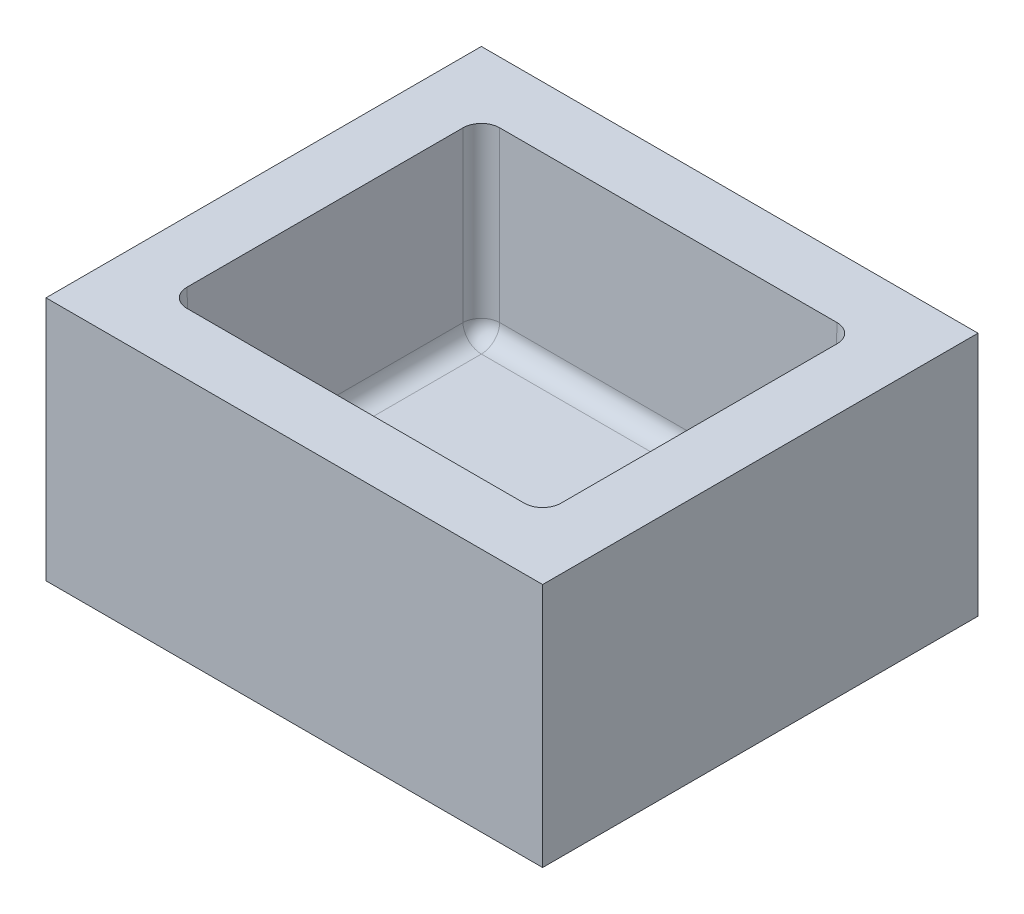
ISO-10303-21;
HEADER;
FILE_DESCRIPTION(('STEP AP214'),'2;1');
FILE_NAME('part.step','',(''),(''),'','','');
FILE_SCHEMA(('AUTOMOTIVE_DESIGN { 1 0 10303 214 1 1 1 1 }'));
ENDSEC;
DATA;
#1=APPLICATION_CONTEXT('core data for automotive mechanical design processes');
#2=APPLICATION_PROTOCOL_DEFINITION('international standard','automotive_design',2000,#1);
#3=PRODUCT_CONTEXT('',#1,'mechanical');
#4=PRODUCT('Part','Part','',(#3));
#5=PRODUCT_RELATED_PRODUCT_CATEGORY('part','',(#4));
#6=PRODUCT_DEFINITION_FORMATION('','',#4);
#7=PRODUCT_DEFINITION_CONTEXT('part definition',#1,'design');
#8=PRODUCT_DEFINITION('design','',#6,#7);
#9=PRODUCT_DEFINITION_SHAPE('','',#8);
#10=(LENGTH_UNIT() NAMED_UNIT(*) SI_UNIT(.MILLI.,.METRE.));
#11=(NAMED_UNIT(*) PLANE_ANGLE_UNIT() SI_UNIT($,.RADIAN.));
#12=(NAMED_UNIT(*) SI_UNIT($,.STERADIAN.) SOLID_ANGLE_UNIT());
#13=UNCERTAINTY_MEASURE_WITH_UNIT(LENGTH_MEASURE(1.E-05),#10,'distance_accuracy_value','');
#14=(GEOMETRIC_REPRESENTATION_CONTEXT(3) GLOBAL_UNCERTAINTY_ASSIGNED_CONTEXT((#13)) GLOBAL_UNIT_ASSIGNED_CONTEXT((#10,
#11,#12)) REPRESENTATION_CONTEXT('',''));
#15=CARTESIAN_POINT('',(0.,0.,0.));
#16=DIRECTION('',(0.,0.,1.));
#17=DIRECTION('',(1.,0.,0.));
#18=AXIS2_PLACEMENT_3D('',#15,#16,#17);
#19=CARTESIAN_POINT('',(70.5236519478465,40.,10.5236519478465));
#20=DIRECTION('',(1.,0.,0.));
#21=DIRECTION('',(0.,0.,-1.));
#22=AXIS2_PLACEMENT_3D('',#19,#20,#21);
#23=PLANE('',#22);
#24=DIRECTION('',(0.,0.,-1.));
#25=VECTOR('',#24,1.);
#26=CARTESIAN_POINT('',(70.5236519478465,30.,10.5236519478465));
#27=LINE('',#26,#25);
#28=CARTESIAN_POINT('',(70.5236519478465,30.,10.5236519478465));
#29=VERTEX_POINT('',#28);
#30=CARTESIAN_POINT('',(70.5236519478465,30.,-60.5236519478465));
#31=VERTEX_POINT('',#30);
#32=EDGE_CURVE('E169',#29,#31,#27,.T.);
#33=ORIENTED_EDGE('',*,*,#32,.F.);
#34=DIRECTION('',(0.,-1.,0.));
#35=VECTOR('',#34,1.);
#36=CARTESIAN_POINT('',(70.5236519478465,40.,10.5236519478465));
#37=LINE('',#36,#35);
#38=CARTESIAN_POINT('',(70.5236519478465,-10.,10.5236519478465));
#39=VERTEX_POINT('',#38);
#40=EDGE_CURVE('E45',#29,#39,#37,.T.);
#41=ORIENTED_EDGE('',*,*,#40,.T.);
#42=DIRECTION('',(0.,0.,1.));
#43=VECTOR('',#42,1.);
#44=CARTESIAN_POINT('',(70.5236519478465,-10.,10.5236519478465));
#45=LINE('',#44,#43);
#46=CARTESIAN_POINT('',(70.5236519478465,-10.,-60.5236519478465));
#47=VERTEX_POINT('',#46);
#48=EDGE_CURVE('E182',#47,#39,#45,.T.);
#49=ORIENTED_EDGE('',*,*,#48,.F.);
#50=DIRECTION('',(0.,-1.,0.));
#51=VECTOR('',#50,1.);
#52=CARTESIAN_POINT('',(70.5236519478465,40.,-60.5236519478465));
#53=LINE('',#52,#51);
#54=EDGE_CURVE('E175',#31,#47,#53,.T.);
#55=ORIENTED_EDGE('',*,*,#54,.F.);
#56=EDGE_LOOP('',(#33,#41,#49,#55));
#57=FACE_BOUND('',#56,.T.);
#58=ADVANCED_FACE('F41',(#57),#23,.T.);
#59=CARTESIAN_POINT('',(70.5236519478465,40.,-60.5236519478465));
#60=DIRECTION('',(0.,0.,-1.));
#61=DIRECTION('',(-1.,0.,0.));
#62=AXIS2_PLACEMENT_3D('',#59,#60,#61);
#63=PLANE('',#62);
#64=DIRECTION('',(-1.,0.,0.));
#65=VECTOR('',#64,1.);
#66=CARTESIAN_POINT('',(70.5236519478465,30.,-60.5236519478465));
#67=LINE('',#66,#65);
#68=CARTESIAN_POINT('',(-10.5236519478465,30.,-60.5236519478465));
#69=VERTEX_POINT('',#68);
#70=EDGE_CURVE('E52',#31,#69,#67,.T.);
#71=ORIENTED_EDGE('',*,*,#70,.F.);
#72=ORIENTED_EDGE('',*,*,#54,.T.);
#73=DIRECTION('',(1.,0.,0.));
#74=VECTOR('',#73,1.);
#75=CARTESIAN_POINT('',(70.5236519478465,-10.,-60.5236519478465));
#76=LINE('',#75,#74);
#77=CARTESIAN_POINT('',(-10.5236519478465,-10.,-60.5236519478465));
#78=VERTEX_POINT('',#77);
#79=EDGE_CURVE('E144',#78,#47,#76,.T.);
#80=ORIENTED_EDGE('',*,*,#79,.F.);
#81=DIRECTION('',(0.,-1.,0.));
#82=VECTOR('',#81,1.);
#83=CARTESIAN_POINT('',(-10.5236519478465,40.,-60.5236519478465));
#84=LINE('',#83,#82);
#85=EDGE_CURVE('E178',#69,#78,#84,.T.);
#86=ORIENTED_EDGE('',*,*,#85,.F.);
#87=EDGE_LOOP('',(#71,#72,#80,#86));
#88=FACE_BOUND('',#87,.T.);
#89=ADVANCED_FACE('F320',(#88),#63,.T.);
#90=CARTESIAN_POINT('',(-10.5236519478465,40.,10.5236519478465));
#91=DIRECTION('',(-1.,0.,0.));
#92=DIRECTION('',(0.,0.,1.));
#93=AXIS2_PLACEMENT_3D('',#90,#91,#92);
#94=PLANE('',#93);
#95=DIRECTION('',(0.,0.,1.));
#96=VECTOR('',#95,1.);
#97=CARTESIAN_POINT('',(-10.5236519478465,30.,10.5236519478465));
#98=LINE('',#97,#96);
#99=CARTESIAN_POINT('',(-10.5236519478465,30.,10.5236519478465));
#100=VERTEX_POINT('',#99);
#101=EDGE_CURVE('E11',#69,#100,#98,.T.);
#102=ORIENTED_EDGE('',*,*,#101,.F.);
#103=ORIENTED_EDGE('',*,*,#85,.T.);
#104=DIRECTION('',(0.,0.,-1.));
#105=VECTOR('',#104,1.);
#106=CARTESIAN_POINT('',(-10.5236519478465,-10.,10.5236519478465));
#107=LINE('',#106,#105);
#108=CARTESIAN_POINT('',(-10.5236519478465,-10.,10.5236519478465));
#109=VERTEX_POINT('',#108);
#110=EDGE_CURVE('E147',#109,#78,#107,.T.);
#111=ORIENTED_EDGE('',*,*,#110,.F.);
#112=DIRECTION('',(0.,-1.,0.));
#113=VECTOR('',#112,1.);
#114=CARTESIAN_POINT('',(-10.5236519478465,40.,10.5236519478465));
#115=LINE('',#114,#113);
#116=EDGE_CURVE('E180',#100,#109,#115,.T.);
#117=ORIENTED_EDGE('',*,*,#116,.F.);
#118=EDGE_LOOP('',(#102,#103,#111,#117));
#119=FACE_BOUND('',#118,.T.);
#120=ADVANCED_FACE('F312',(#119),#94,.T.);
#121=CARTESIAN_POINT('',(70.5236519478465,40.,10.5236519478465));
#122=DIRECTION('',(0.,0.,1.));
#123=DIRECTION('',(1.,0.,0.));
#124=AXIS2_PLACEMENT_3D('',#121,#122,#123);
#125=PLANE('',#124);
#126=DIRECTION('',(1.,0.,0.));
#127=VECTOR('',#126,1.);
#128=CARTESIAN_POINT('',(70.5236519478465,30.,10.5236519478465));
#129=LINE('',#128,#127);
#130=EDGE_CURVE('E172',#100,#29,#129,.T.);
#131=ORIENTED_EDGE('',*,*,#130,.F.);
#132=ORIENTED_EDGE('',*,*,#116,.T.);
#133=DIRECTION('',(-1.,0.,0.));
#134=VECTOR('',#133,1.);
#135=CARTESIAN_POINT('',(70.5236519478465,-10.,10.5236519478465));
#136=LINE('',#135,#134);
#137=EDGE_CURVE('E190',#39,#109,#136,.T.);
#138=ORIENTED_EDGE('',*,*,#137,.F.);
#139=ORIENTED_EDGE('',*,*,#40,.F.);
#140=EDGE_LOOP('',(#131,#132,#138,#139));
#141=FACE_BOUND('',#140,.T.);
#142=ADVANCED_FACE('F315',(#141),#125,.T.);
#143=CARTESIAN_POINT('',(0.,-10.,0.));
#144=DIRECTION('',(0.,1.,0.));
#145=DIRECTION('',(0.,0.,1.));
#146=AXIS2_PLACEMENT_3D('',#143,#144,#145);
#147=PLANE('',#146);
#148=ORIENTED_EDGE('',*,*,#48,.T.);
#149=ORIENTED_EDGE('',*,*,#137,.T.);
#150=ORIENTED_EDGE('',*,*,#110,.T.);
#151=ORIENTED_EDGE('',*,*,#79,.T.);
#152=EDGE_LOOP('',(#148,#149,#150,#151));
#153=FACE_BOUND('',#152,.T.);
#154=ADVANCED_FACE('F323',(#153),#147,.F.);
#155=CARTESIAN_POINT('',(0.,0.,0.));
#156=DIRECTION('',(0.,1.,0.));
#157=DIRECTION('',(0.,0.,1.));
#158=AXIS2_PLACEMENT_3D('',#155,#156,#157);
#159=PLANE('',#158);
#160=DIRECTION('',(0.,0.,1.));
#161=VECTOR('',#160,1.);
#162=CARTESIAN_POINT('',(57.0519082106529,0.,0.));
#163=LINE('',#162,#161);
#164=CARTESIAN_POINT('',(57.0519082106529,0.,-47.0519082106529));
#165=VERTEX_POINT('',#164);
#166=CARTESIAN_POINT('',(57.0519082106529,0.,-2.94809178934707));
#167=VERTEX_POINT('',#166);
#168=EDGE_CURVE('E162',#165,#167,#163,.T.);
#169=ORIENTED_EDGE('',*,*,#168,.F.);
#170=DIRECTION('',(1.,0.,0.));
#171=VECTOR('',#170,1.);
#172=CARTESIAN_POINT('',(60.,0.,-47.0519082106529));
#173=LINE('',#172,#171);
#174=CARTESIAN_POINT('',(2.94809178934707,0.,-47.0519082106529));
#175=VERTEX_POINT('',#174);
#176=EDGE_CURVE('E157',#175,#165,#173,.T.);
#177=ORIENTED_EDGE('',*,*,#176,.F.);
#178=DIRECTION('',(0.,0.,-1.));
#179=VECTOR('',#178,1.);
#180=CARTESIAN_POINT('',(2.94809178934707,0.,-50.));
#181=LINE('',#180,#179);
#182=CARTESIAN_POINT('',(2.94809178934707,0.,-2.94809178934707));
#183=VERTEX_POINT('',#182);
#184=EDGE_CURVE('E153',#183,#175,#181,.T.);
#185=ORIENTED_EDGE('',*,*,#184,.F.);
#186=DIRECTION('',(-1.,0.,0.));
#187=VECTOR('',#186,1.);
#188=CARTESIAN_POINT('',(0.,0.,-2.94809178934707));
#189=LINE('',#188,#187);
#190=EDGE_CURVE('E140',#167,#183,#189,.T.);
#191=ORIENTED_EDGE('',*,*,#190,.F.);
#192=EDGE_LOOP('',(#169,#177,#185,#191));
#193=FACE_BOUND('',#192,.T.);
#194=ADVANCED_FACE('F271',(#193),#159,.T.);
#195=CARTESIAN_POINT('',(2.94809178934707,3.,-2.94809178934707));
#196=DIRECTION('',(0.,0.,1.));
#197=DIRECTION('',(1.,0.,0.));
#198=AXIS2_PLACEMENT_3D('',#195,#196,#197);
#199=SPHERICAL_SURFACE('',#198,3.);
#200=CARTESIAN_POINT('',(2.94809178934707,3.,-2.94809178934707));
#201=DIRECTION('',(0.0174497491606827,-0.999695459881887,-0.0174497491606827));
#202=DIRECTION('',(0.,0.0174524064372835,-0.999847695156391));
#203=AXIS2_PLACEMENT_3D('',#200,#201,#202);
#204=CIRCLE('',#203,3.);
#205=CARTESIAN_POINT('',(2.94809178934707,2.94764278068815,0.0514512961221036));
#206=VERTEX_POINT('',#205);
#207=CARTESIAN_POINT('',(-0.0514512961221036,2.94764278068815,-2.94809178934707));
#208=VERTEX_POINT('',#207);
#209=EDGE_CURVE('E109',#206,#208,#204,.T.);
#210=ORIENTED_EDGE('',*,*,#209,.F.);
#211=CARTESIAN_POINT('',(2.94809178934707,3.,-2.94809178934707));
#212=DIRECTION('',(-1.,0.,0.));
#213=DIRECTION('',(0.,0.,1.));
#214=AXIS2_PLACEMENT_3D('',#211,#212,#213);
#215=CIRCLE('',#214,3.);
#216=EDGE_CURVE('E113',#206,#183,#215,.F.);
#217=ORIENTED_EDGE('',*,*,#216,.T.);
#218=CARTESIAN_POINT('',(2.94809178934707,3.,-2.94809178934707));
#219=DIRECTION('',(0.,0.,1.));
#220=DIRECTION('',(1.,0.,0.));
#221=AXIS2_PLACEMENT_3D('',#218,#219,#220);
#222=CIRCLE('',#221,3.);
#223=EDGE_CURVE('E116',#208,#183,#222,.T.);
#224=ORIENTED_EDGE('',*,*,#223,.F.);
#225=EDGE_LOOP('',(#210,#217,#224));
#226=FACE_BOUND('',#225,.T.);
#227=ADVANCED_FACE('F111',(#226),#199,.F.);
#228=CARTESIAN_POINT('',(0.,3.,-2.94809178934707));
#229=DIRECTION('',(1.,0.,0.));
#230=DIRECTION('',(0.,0.,-1.));
#231=AXIS2_PLACEMENT_3D('',#228,#229,#230);
#232=CYLINDRICAL_SURFACE('',#231,3.);
#233=ORIENTED_EDGE('',*,*,#216,.F.);
#234=DIRECTION('',(1.,0.,0.));
#235=VECTOR('',#234,1.);
#236=CARTESIAN_POINT('',(60.,2.94764278068815,0.0514512961221035));
#237=LINE('',#236,#235);
#238=CARTESIAN_POINT('',(57.0519082106529,2.94764278068815,0.0514512961221036));
#239=VERTEX_POINT('',#238);
#240=EDGE_CURVE('E134',#206,#239,#237,.T.);
#241=ORIENTED_EDGE('',*,*,#240,.T.);
#242=CARTESIAN_POINT('',(57.0519082106529,3.,-2.94809178934707));
#243=DIRECTION('',(1.,0.,0.));
#244=DIRECTION('',(0.,1.,0.));
#245=AXIS2_PLACEMENT_3D('',#242,#243,#244);
#246=CIRCLE('',#245,3.);
#247=EDGE_CURVE('E165',#167,#239,#246,.F.);
#248=ORIENTED_EDGE('',*,*,#247,.F.);
#249=ORIENTED_EDGE('',*,*,#190,.T.);
#250=EDGE_LOOP('',(#233,#241,#248,#249));
#251=FACE_BOUND('',#250,.T.);
#252=ADVANCED_FACE('F142',(#251),#232,.F.);
#253=CARTESIAN_POINT('',(0.,0.,0.));
#254=DIRECTION('',(0.,-0.0174524064372835,0.999847695156391));
#255=DIRECTION('',(0.,-0.999847695156391,-0.0174524064372835));
#256=AXIS2_PLACEMENT_3D('',#253,#254,#255);
#257=PLANE('',#256);
#258=DIRECTION('',(-1.,0.,0.));
#259=VECTOR('',#258,1.);
#260=CARTESIAN_POINT('',(0.,30.,0.523651947846529));
#261=LINE('',#260,#259);
#262=CARTESIAN_POINT('',(2.47589113762265,30.,0.523651947846529));
#263=VERTEX_POINT('',#262);
#264=CARTESIAN_POINT('',(57.5241088623774,30.,0.523651947846529));
#265=VERTEX_POINT('',#264);
#266=EDGE_CURVE('E152',#263,#265,#261,.F.);
#267=ORIENTED_EDGE('',*,*,#266,.T.);
#268=DIRECTION('',(0.0174497491606827,0.999695459881888,0.0174497491606827));
#269=VECTOR('',#268,1.);
#270=CARTESIAN_POINT('',(56.9831006318943,-0.99434076630054,-0.0173562826365496));
#271=LINE('',#270,#269);
#272=EDGE_CURVE('E137',#239,#265,#271,.T.);
#273=ORIENTED_EDGE('',*,*,#272,.F.);
#274=ORIENTED_EDGE('',*,*,#240,.F.);
#275=DIRECTION('',(-0.0174497491606827,0.999695459881888,0.0174497491606827));
#276=VECTOR('',#275,1.);
#277=CARTESIAN_POINT('',(2.99862974335948,0.0523253344201978,0.000913342109695253));
#278=LINE('',#277,#276);
#279=EDGE_CURVE('E121',#263,#206,#278,.F.);
#280=ORIENTED_EDGE('',*,*,#279,.F.);
#281=EDGE_LOOP('',(#267,#273,#274,#280));
#282=FACE_BOUND('',#281,.T.);
#283=ADVANCED_FACE('F135',(#282),#257,.F.);
#284=CARTESIAN_POINT('',(57.0013702566405,0.104682553732048,-2.99862974335948));
#285=DIRECTION('',(-0.0174497491606827,-0.999695459881887,-0.0174497491606827));
#286=DIRECTION('',(0.,0.0174524064372835,-0.999847695156391));
#287=AXIS2_PLACEMENT_3D('',#284,#285,#286);
#288=CYLINDRICAL_SURFACE('',#287,3.);
#289=CARTESIAN_POINT('',(57.5231949637148,30.,-2.47680503628519));
#290=DIRECTION('',(0.,-1.,0.));
#291=DIRECTION('',(-0.707106781186548,0.,-0.707106781186548));
#292=AXIS2_PLACEMENT_3D('',#289,#290,#291);
#293=ELLIPSE('',#292,3.00091389867315,3.);
#294=CARTESIAN_POINT('',(60.5236519478465,30.,-2.47589113762264));
#295=VERTEX_POINT('',#294);
#296=EDGE_CURVE('E258',#265,#295,#293,.F.);
#297=ORIENTED_EDGE('',*,*,#296,.T.);
#298=DIRECTION('',(0.0174497491606827,0.999695459881888,0.0174497491606827));
#299=VECTOR('',#298,1.);
#300=CARTESIAN_POINT('',(60.0009133421097,0.0523253344201978,-2.99862974335948));
#301=LINE('',#300,#299);
#302=CARTESIAN_POINT('',(60.0514512961221,2.94764278068815,-2.94809178934707));
#303=VERTEX_POINT('',#302);
#304=EDGE_CURVE('E255',#295,#303,#301,.F.);
#305=ORIENTED_EDGE('',*,*,#304,.T.);
#306=CARTESIAN_POINT('',(57.0519082106529,3.,-2.94809178934707));
#307=DIRECTION('',(-0.0174497491606827,-0.999695459881887,-0.0174497491606828));
#308=DIRECTION('',(0.,0.0174524064372836,-0.999847695156391));
#309=AXIS2_PLACEMENT_3D('',#306,#307,#308);
#310=CIRCLE('',#309,3.);
#311=EDGE_CURVE('E253',#303,#239,#310,.T.);
#312=ORIENTED_EDGE('',*,*,#311,.T.);
#313=ORIENTED_EDGE('',*,*,#272,.T.);
#314=EDGE_LOOP('',(#297,#305,#312,#313));
#315=FACE_BOUND('',#314,.T.);
#316=ADVANCED_FACE('F347',(#315),#288,.F.);
#317=CARTESIAN_POINT('',(57.0519082106529,3.,-2.94809178934707));
#318=DIRECTION('',(0.,0.,1.));
#319=DIRECTION('',(1.,0.,0.));
#320=AXIS2_PLACEMENT_3D('',#317,#318,#319);
#321=SPHERICAL_SURFACE('',#320,3.);
#322=CARTESIAN_POINT('',(57.0519082106529,3.,-2.94809178934707));
#323=DIRECTION('',(0.,0.,1.));
#324=DIRECTION('',(1.,0.,0.));
#325=AXIS2_PLACEMENT_3D('',#322,#323,#324);
#326=CIRCLE('',#325,3.);
#327=EDGE_CURVE('E164',#167,#303,#326,.T.);
#328=ORIENTED_EDGE('',*,*,#327,.F.);
#329=ORIENTED_EDGE('',*,*,#247,.T.);
#330=ORIENTED_EDGE('',*,*,#311,.F.);
#331=EDGE_LOOP('',(#328,#329,#330));
#332=FACE_BOUND('',#331,.T.);
#333=ADVANCED_FACE('F268',(#332),#321,.F.);
#334=CARTESIAN_POINT('',(57.0519082106529,3.,0.));
#335=DIRECTION('',(0.,0.,-1.));
#336=DIRECTION('',(-1.,0.,0.));
#337=AXIS2_PLACEMENT_3D('',#334,#335,#336);
#338=CYLINDRICAL_SURFACE('',#337,3.);
#339=CARTESIAN_POINT('',(57.0519082106529,3.,-47.0519082106529));
#340=DIRECTION('',(0.,0.,-1.));
#341=DIRECTION('',(0.,1.,0.));
#342=AXIS2_PLACEMENT_3D('',#339,#340,#341);
#343=CIRCLE('',#342,3.);
#344=CARTESIAN_POINT('',(60.0514512961221,2.94764278068815,-47.0519082106529));
#345=VERTEX_POINT('',#344);
#346=EDGE_CURVE('E230',#165,#345,#343,.F.);
#347=ORIENTED_EDGE('',*,*,#346,.F.);
#348=ORIENTED_EDGE('',*,*,#168,.T.);
#349=ORIENTED_EDGE('',*,*,#327,.T.);
#350=DIRECTION('',(0.,0.,-1.));
#351=VECTOR('',#350,1.);
#352=CARTESIAN_POINT('',(60.0514512961221,2.94764278068815,-50.));
#353=LINE('',#352,#351);
#354=EDGE_CURVE('E246',#303,#345,#353,.T.);
#355=ORIENTED_EDGE('',*,*,#354,.T.);
#356=EDGE_LOOP('',(#347,#348,#349,#355));
#357=FACE_BOUND('',#356,.T.);
#358=ADVANCED_FACE('F353',(#357),#338,.F.);
#359=CARTESIAN_POINT('',(60.,0.,0.));
#360=DIRECTION('',(0.999847695156391,-0.0174524064372835,0.));
#361=DIRECTION('',(0.0174524064372835,0.999847695156391,0.));
#362=AXIS2_PLACEMENT_3D('',#359,#360,#361);
#363=PLANE('',#362);
#364=ORIENTED_EDGE('',*,*,#354,.F.);
#365=ORIENTED_EDGE('',*,*,#304,.F.);
#366=DIRECTION('',(0.,0.,1.));
#367=VECTOR('',#366,1.);
#368=CARTESIAN_POINT('',(60.5236519478465,30.,0.));
#369=LINE('',#368,#367);
#370=CARTESIAN_POINT('',(60.5236519478465,30.,-47.5241088623774));
#371=VERTEX_POINT('',#370);
#372=EDGE_CURVE('E241',#295,#371,#369,.F.);
#373=ORIENTED_EDGE('',*,*,#372,.T.);
#374=DIRECTION('',(0.0174497491606827,0.999695459881888,-0.0174497491606827));
#375=VECTOR('',#374,1.);
#376=CARTESIAN_POINT('',(59.9856886548212,-0.819896416180417,-46.986145569352));
#377=LINE('',#376,#375);
#378=EDGE_CURVE('E235',#345,#371,#377,.T.);
#379=ORIENTED_EDGE('',*,*,#378,.F.);
#380=EDGE_LOOP('',(#364,#365,#373,#379));
#381=FACE_BOUND('',#380,.T.);
#382=ADVANCED_FACE('F356',(#381),#363,.F.);
#383=CARTESIAN_POINT('',(56.9831006318943,-0.941983546988689,-46.9831006318943));
#384=DIRECTION('',(-0.0174497491606827,-0.999695459881887,0.0174497491606827));
#385=DIRECTION('',(0.,-0.0174524064372835,-0.999847695156391));
#386=AXIS2_PLACEMENT_3D('',#383,#384,#385);
#387=CYLINDRICAL_SURFACE('',#386,3.);
#388=CARTESIAN_POINT('',(57.5231949637148,30.,-47.5231949637148));
#389=DIRECTION('',(0.,-1.,0.));
#390=DIRECTION('',(-0.707106781186548,0.,0.707106781186548));
#391=AXIS2_PLACEMENT_3D('',#388,#389,#390);
#392=ELLIPSE('',#391,3.00091389867315,3.);
#393=CARTESIAN_POINT('',(57.5241088623773,30.,-50.5236519478465));
#394=VERTEX_POINT('',#393);
#395=EDGE_CURVE('E61',#371,#394,#392,.F.);
#396=ORIENTED_EDGE('',*,*,#395,.T.);
#397=DIRECTION('',(0.0174497491606827,0.999695459881888,-0.0174497491606827));
#398=VECTOR('',#397,1.);
#399=CARTESIAN_POINT('',(56.9831006318943,-0.99434076630054,-49.9826437173635));
#400=LINE('',#399,#398);
#401=CARTESIAN_POINT('',(57.0519082106529,2.94764278068815,-50.0514512961221));
#402=VERTEX_POINT('',#401);
#403=EDGE_CURVE('E236',#394,#402,#400,.F.);
#404=ORIENTED_EDGE('',*,*,#403,.T.);
#405=CARTESIAN_POINT('',(57.0519082106529,3.,-47.0519082106529));
#406=DIRECTION('',(-0.0174497491606827,-0.999695459881887,0.0174497491606827));
#407=DIRECTION('',(0.999847695156391,-0.0174524064372835,0.));
#408=AXIS2_PLACEMENT_3D('',#405,#406,#407);
#409=CIRCLE('',#408,3.);
#410=EDGE_CURVE('E233',#402,#345,#409,.T.);
#411=ORIENTED_EDGE('',*,*,#410,.T.);
#412=ORIENTED_EDGE('',*,*,#378,.T.);
#413=EDGE_LOOP('',(#396,#404,#411,#412));
#414=FACE_BOUND('',#413,.T.);
#415=ADVANCED_FACE('F360',(#414),#387,.F.);
#416=CARTESIAN_POINT('',(57.0519082106529,3.,-47.0519082106529));
#417=DIRECTION('',(0.,0.,1.));
#418=DIRECTION('',(1.,0.,0.));
#419=AXIS2_PLACEMENT_3D('',#416,#417,#418);
#420=SPHERICAL_SURFACE('',#419,3.);
#421=CARTESIAN_POINT('',(57.0519082106529,3.,-47.0519082106529));
#422=DIRECTION('',(1.,0.,0.));
#423=DIRECTION('',(0.,0.,-1.));
#424=AXIS2_PLACEMENT_3D('',#421,#422,#423);
#425=CIRCLE('',#424,3.);
#426=EDGE_CURVE('E160',#165,#402,#425,.T.);
#427=ORIENTED_EDGE('',*,*,#426,.F.);
#428=ORIENTED_EDGE('',*,*,#346,.T.);
#429=ORIENTED_EDGE('',*,*,#410,.F.);
#430=EDGE_LOOP('',(#427,#428,#429));
#431=FACE_BOUND('',#430,.T.);
#432=ADVANCED_FACE('F364',(#431),#420,.F.);
#433=CARTESIAN_POINT('',(0.,3.,-47.0519082106529));
#434=DIRECTION('',(-1.,0.,0.));
#435=DIRECTION('',(0.,0.,1.));
#436=AXIS2_PLACEMENT_3D('',#433,#434,#435);
#437=CYLINDRICAL_SURFACE('',#436,3.);
#438=CARTESIAN_POINT('',(2.94809178934707,3.,-47.0519082106529));
#439=DIRECTION('',(-1.,0.,0.));
#440=DIRECTION('',(0.,-1.,0.));
#441=AXIS2_PLACEMENT_3D('',#438,#439,#440);
#442=CIRCLE('',#441,3.);
#443=CARTESIAN_POINT('',(2.94809178934707,2.94764278068815,-50.0514512961221));
#444=VERTEX_POINT('',#443);
#445=EDGE_CURVE('E161',#444,#175,#442,.T.);
#446=ORIENTED_EDGE('',*,*,#445,.T.);
#447=ORIENTED_EDGE('',*,*,#176,.T.);
#448=ORIENTED_EDGE('',*,*,#426,.T.);
#449=DIRECTION('',(-1.,0.,0.));
#450=VECTOR('',#449,1.);
#451=CARTESIAN_POINT('',(0.,2.94764278068815,-50.0514512961221));
#452=LINE('',#451,#450);
#453=EDGE_CURVE('E225',#402,#444,#452,.T.);
#454=ORIENTED_EDGE('',*,*,#453,.T.);
#455=EDGE_LOOP('',(#446,#447,#448,#454));
#456=FACE_BOUND('',#455,.T.);
#457=ADVANCED_FACE('F368',(#456),#437,.F.);
#458=CARTESIAN_POINT('',(0.,0.,-50.));
#459=DIRECTION('',(0.,-0.0174524064372835,-0.999847695156391));
#460=DIRECTION('',(0.,0.999847695156391,-0.0174524064372835));
#461=AXIS2_PLACEMENT_3D('',#458,#459,#460);
#462=PLANE('',#461);
#463=ORIENTED_EDGE('',*,*,#453,.F.);
#464=ORIENTED_EDGE('',*,*,#403,.F.);
#465=DIRECTION('',(1.,0.,0.));
#466=VECTOR('',#465,1.);
#467=CARTESIAN_POINT('',(0.,30.,-50.5236519478465));
#468=LINE('',#467,#466);
#469=CARTESIAN_POINT('',(2.47589113762264,30.,-50.5236519478465));
#470=VERTEX_POINT('',#469);
#471=EDGE_CURVE('E219',#394,#470,#468,.F.);
#472=ORIENTED_EDGE('',*,*,#471,.T.);
#473=DIRECTION('',(-0.0174497491606827,0.999695459881888,-0.0174497491606827));
#474=VECTOR('',#473,1.);
#475=CARTESIAN_POINT('',(2.99862974335948,0.0523253344201978,-50.0009133421097));
#476=LINE('',#475,#474);
#477=EDGE_CURVE('E209',#444,#470,#476,.T.);
#478=ORIENTED_EDGE('',*,*,#477,.F.);
#479=EDGE_LOOP('',(#463,#464,#472,#478));
#480=FACE_BOUND('',#479,.T.);
#481=ADVANCED_FACE('F372',(#480),#462,.F.);
#482=CARTESIAN_POINT('',(3.01385443064802,-0.767539196868566,-46.986145569352));
#483=DIRECTION('',(0.0174497491606827,-0.999695459881887,0.0174497491606827));
#484=DIRECTION('',(0.,-0.0174524064372835,-0.999847695156391));
#485=AXIS2_PLACEMENT_3D('',#482,#483,#484);
#486=CYLINDRICAL_SURFACE('',#485,3.);
#487=CARTESIAN_POINT('',(2.47680503628519,30.,-47.5231949637148));
#488=DIRECTION('',(0.,-1.,0.));
#489=DIRECTION('',(0.707106781186548,0.,0.707106781186548));
#490=AXIS2_PLACEMENT_3D('',#487,#488,#489);
#491=ELLIPSE('',#490,3.00091389867315,3.);
#492=CARTESIAN_POINT('',(-0.523651947846529,30.,-47.5241088623774));
#493=VERTEX_POINT('',#492);
#494=EDGE_CURVE('E215',#470,#493,#491,.F.);
#495=ORIENTED_EDGE('',*,*,#494,.T.);
#496=DIRECTION('',(-0.0174497491606827,0.999695459881888,-0.0174497491606827));
#497=VECTOR('',#496,1.);
#498=CARTESIAN_POINT('',(0.0143113451788421,-0.819896416180417,-46.986145569352));
#499=LINE('',#498,#497);
#500=CARTESIAN_POINT('',(-0.0514512961221036,2.94764278068815,-47.0519082106529));
#501=VERTEX_POINT('',#500);
#502=EDGE_CURVE('E212',#493,#501,#499,.F.);
#503=ORIENTED_EDGE('',*,*,#502,.T.);
#504=CARTESIAN_POINT('',(2.94809178934707,3.,-47.0519082106529));
#505=DIRECTION('',(0.0174497491606827,-0.999695459881887,0.0174497491606827));
#506=DIRECTION('',(0.999847695156391,0.0174524064372835,0.));
#507=AXIS2_PLACEMENT_3D('',#504,#505,#506);
#508=CIRCLE('',#507,3.);
#509=EDGE_CURVE('E210',#501,#444,#508,.T.);
#510=ORIENTED_EDGE('',*,*,#509,.T.);
#511=ORIENTED_EDGE('',*,*,#477,.T.);
#512=EDGE_LOOP('',(#495,#503,#510,#511));
#513=FACE_BOUND('',#512,.T.);
#514=ADVANCED_FACE('F283',(#513),#486,.F.);
#515=CARTESIAN_POINT('',(2.94809178934707,3.,-47.0519082106529));
#516=DIRECTION('',(0.,0.,1.));
#517=DIRECTION('',(1.,0.,0.));
#518=AXIS2_PLACEMENT_3D('',#515,#516,#517);
#519=SPHERICAL_SURFACE('',#518,3.);
#520=ORIENTED_EDGE('',*,*,#509,.F.);
#521=CARTESIAN_POINT('',(2.94809178934707,3.,-47.0519082106529));
#522=DIRECTION('',(0.,0.,-1.));
#523=DIRECTION('',(-1.,0.,0.));
#524=AXIS2_PLACEMENT_3D('',#521,#522,#523);
#525=CIRCLE('',#524,3.);
#526=EDGE_CURVE('E207',#501,#175,#525,.F.);
#527=ORIENTED_EDGE('',*,*,#526,.T.);
#528=ORIENTED_EDGE('',*,*,#445,.F.);
#529=EDGE_LOOP('',(#520,#527,#528));
#530=FACE_BOUND('',#529,.T.);
#531=ADVANCED_FACE('F379',(#530),#519,.F.);
#532=CARTESIAN_POINT('',(2.94809178934707,3.,0.));
#533=DIRECTION('',(0.,0.,1.));
#534=DIRECTION('',(1.,0.,0.));
#535=AXIS2_PLACEMENT_3D('',#532,#533,#534);
#536=CYLINDRICAL_SURFACE('',#535,3.);
#537=ORIENTED_EDGE('',*,*,#526,.F.);
#538=DIRECTION('',(0.,0.,1.));
#539=VECTOR('',#538,1.);
#540=CARTESIAN_POINT('',(-0.0514512961221035,2.94764278068815,0.));
#541=LINE('',#540,#539);
#542=EDGE_CURVE('E205',#501,#208,#541,.T.);
#543=ORIENTED_EDGE('',*,*,#542,.T.);
#544=ORIENTED_EDGE('',*,*,#223,.T.);
#545=ORIENTED_EDGE('',*,*,#184,.T.);
#546=EDGE_LOOP('',(#537,#543,#544,#545));
#547=FACE_BOUND('',#546,.T.);
#548=ADVANCED_FACE('F275',(#547),#536,.F.);
#549=CARTESIAN_POINT('',(0.,0.,0.));
#550=DIRECTION('',(-0.999847695156391,-0.0174524064372835,0.));
#551=DIRECTION('',(0.0174524064372835,-0.999847695156391,0.));
#552=AXIS2_PLACEMENT_3D('',#549,#550,#551);
#553=PLANE('',#552);
#554=ORIENTED_EDGE('',*,*,#542,.F.);
#555=ORIENTED_EDGE('',*,*,#502,.F.);
#556=DIRECTION('',(0.,0.,-1.));
#557=VECTOR('',#556,1.);
#558=CARTESIAN_POINT('',(-0.523651947846529,30.,0.));
#559=LINE('',#558,#557);
#560=CARTESIAN_POINT('',(-0.523651947846529,30.,-2.47589113762265));
#561=VERTEX_POINT('',#560);
#562=EDGE_CURVE('E156',#493,#561,#559,.F.);
#563=ORIENTED_EDGE('',*,*,#562,.T.);
#564=DIRECTION('',(-0.0174497491606827,0.999695459881888,0.0174497491606827));
#565=VECTOR('',#564,1.);
#566=CARTESIAN_POINT('',(-0.000913342109695253,0.0523253344201978,-2.99862974335948));
#567=LINE('',#566,#565);
#568=EDGE_CURVE('E120',#208,#561,#567,.T.);
#569=ORIENTED_EDGE('',*,*,#568,.F.);
#570=EDGE_LOOP('',(#554,#555,#563,#569));
#571=FACE_BOUND('',#570,.T.);
#572=ADVANCED_FACE('F280',(#571),#553,.F.);
#573=CARTESIAN_POINT('',(2.99862974335948,0.104682553732048,-2.99862974335948));
#574=DIRECTION('',(0.0174497491606827,-0.999695459881887,-0.0174497491606827));
#575=DIRECTION('',(0.,0.0174524064372835,-0.999847695156391));
#576=AXIS2_PLACEMENT_3D('',#573,#574,#575);
#577=CYLINDRICAL_SURFACE('',#576,3.);
#578=CARTESIAN_POINT('',(2.47680503628519,30.,-2.47680503628519));
#579=DIRECTION('',(0.,-1.,0.));
#580=DIRECTION('',(0.707106781186548,0.,-0.707106781186548));
#581=AXIS2_PLACEMENT_3D('',#578,#579,#580);
#582=ELLIPSE('',#581,3.00091389867315,3.);
#583=EDGE_CURVE('E128',#561,#263,#582,.F.);
#584=ORIENTED_EDGE('',*,*,#583,.T.);
#585=ORIENTED_EDGE('',*,*,#279,.T.);
#586=ORIENTED_EDGE('',*,*,#209,.T.);
#587=ORIENTED_EDGE('',*,*,#568,.T.);
#588=EDGE_LOOP('',(#584,#585,#586,#587));
#589=FACE_BOUND('',#588,.T.);
#590=ADVANCED_FACE('F126',(#589),#577,.F.);
#591=CARTESIAN_POINT('',(-0.523651947846529,30.,-47.5241088623774));
#592=DIRECTION('',(0.,-1.,0.));
#593=DIRECTION('',(0.,0.,1.));
#594=AXIS2_PLACEMENT_3D('',#591,#592,#593);
#595=PLANE('',#594);
#596=ORIENTED_EDGE('',*,*,#130,.T.);
#597=ORIENTED_EDGE('',*,*,#32,.T.);
#598=ORIENTED_EDGE('',*,*,#70,.T.);
#599=ORIENTED_EDGE('',*,*,#101,.T.);
#600=EDGE_LOOP('',(#596,#597,#598,#599));
#601=FACE_BOUND('',#600,.T.);
#602=ORIENTED_EDGE('',*,*,#372,.F.);
#603=ORIENTED_EDGE('',*,*,#296,.F.);
#604=ORIENTED_EDGE('',*,*,#266,.F.);
#605=ORIENTED_EDGE('',*,*,#583,.F.);
#606=ORIENTED_EDGE('',*,*,#562,.F.);
#607=ORIENTED_EDGE('',*,*,#494,.F.);
#608=ORIENTED_EDGE('',*,*,#471,.F.);
#609=ORIENTED_EDGE('',*,*,#395,.F.);
#610=EDGE_LOOP('',(#602,#603,#604,#605,#606,#607,#608,#609));
#611=FACE_BOUND('',#610,.T.);
#612=ADVANCED_FACE('F43',(#601,#611),#595,.F.);
#613=CLOSED_SHELL('',(#58,#89,#120,#142,#154,#194,#227,#252,#283,#316,#333,#358,#382,#415,#432,
#457,#481,#514,#531,#548,#572,#590,#612));
#614=MANIFOLD_SOLID_BREP('B2',#613);
#615=ADVANCED_BREP_SHAPE_REPRESENTATION('',(#18,#614),#14);
#616=SHAPE_DEFINITION_REPRESENTATION(#9,#615);
ENDSEC;
END-ISO-10303-21;
